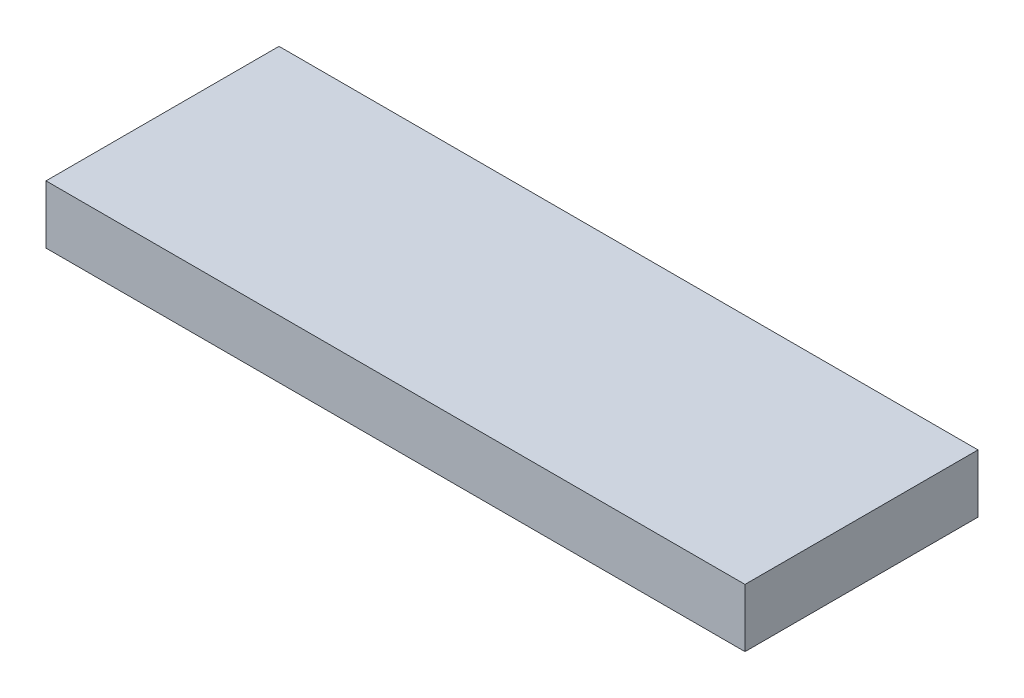
ISO-10303-21;
HEADER;
FILE_DESCRIPTION(('STEP AP214'),'2;1');
FILE_NAME('part.step','',(''),(''),'','','');
FILE_SCHEMA(('AUTOMOTIVE_DESIGN { 1 0 10303 214 1 1 1 1 }'));
ENDSEC;
DATA;
#1=APPLICATION_CONTEXT('core data for automotive mechanical design processes');
#2=APPLICATION_PROTOCOL_DEFINITION('international standard','automotive_design',2000,#1);
#3=PRODUCT_CONTEXT('',#1,'mechanical');
#4=PRODUCT('Part','Part','',(#3));
#5=PRODUCT_RELATED_PRODUCT_CATEGORY('part','',(#4));
#6=PRODUCT_DEFINITION_FORMATION('','',#4);
#7=PRODUCT_DEFINITION_CONTEXT('part definition',#1,'design');
#8=PRODUCT_DEFINITION('design','',#6,#7);
#9=PRODUCT_DEFINITION_SHAPE('','',#8);
#10=(LENGTH_UNIT() NAMED_UNIT(*) SI_UNIT(.MILLI.,.METRE.));
#11=(NAMED_UNIT(*) PLANE_ANGLE_UNIT() SI_UNIT($,.RADIAN.));
#12=(NAMED_UNIT(*) SI_UNIT($,.STERADIAN.) SOLID_ANGLE_UNIT());
#13=UNCERTAINTY_MEASURE_WITH_UNIT(LENGTH_MEASURE(1.E-05),#10,'distance_accuracy_value','');
#14=(GEOMETRIC_REPRESENTATION_CONTEXT(3) GLOBAL_UNCERTAINTY_ASSIGNED_CONTEXT((#13)) GLOBAL_UNIT_ASSIGNED_CONTEXT((#10,
#11,#12)) REPRESENTATION_CONTEXT('',''));
#15=CARTESIAN_POINT('',(0.,0.,0.));
#16=DIRECTION('',(0.,0.,1.));
#17=DIRECTION('',(1.,0.,0.));
#18=AXIS2_PLACEMENT_3D('',#15,#16,#17);
#19=CARTESIAN_POINT('',(60.,10.,-20.));
#20=DIRECTION('',(-1.,0.,0.));
#21=DIRECTION('',(0.,0.,1.));
#22=AXIS2_PLACEMENT_3D('',#19,#20,#21);
#23=PLANE('',#22);
#24=DIRECTION('',(0.,0.,-1.));
#25=VECTOR('',#24,1.);
#26=CARTESIAN_POINT('',(60.,0.,-20.));
#27=LINE('',#26,#25);
#28=CARTESIAN_POINT('',(60.,0.,20.));
#29=VERTEX_POINT('',#28);
#30=CARTESIAN_POINT('',(60.,0.,-20.));
#31=VERTEX_POINT('',#30);
#32=EDGE_CURVE('E96',#29,#31,#27,.T.);
#33=ORIENTED_EDGE('',*,*,#32,.T.);
#34=DIRECTION('',(0.,-1.,0.));
#35=VECTOR('',#34,1.);
#36=CARTESIAN_POINT('',(60.,10.,-20.));
#37=LINE('',#36,#35);
#38=CARTESIAN_POINT('',(60.,10.,-20.));
#39=VERTEX_POINT('',#38);
#40=EDGE_CURVE('E11',#39,#31,#37,.T.);
#41=ORIENTED_EDGE('',*,*,#40,.F.);
#42=DIRECTION('',(0.,0.,-1.));
#43=VECTOR('',#42,1.);
#44=CARTESIAN_POINT('',(60.,10.,-20.));
#45=LINE('',#44,#43);
#46=CARTESIAN_POINT('',(60.,10.,20.));
#47=VERTEX_POINT('',#46);
#48=EDGE_CURVE('E84',#47,#39,#45,.T.);
#49=ORIENTED_EDGE('',*,*,#48,.F.);
#50=DIRECTION('',(0.,-1.,0.));
#51=VECTOR('',#50,1.);
#52=CARTESIAN_POINT('',(60.,10.,20.));
#53=LINE('',#52,#51);
#54=EDGE_CURVE('E92',#47,#29,#53,.T.);
#55=ORIENTED_EDGE('',*,*,#54,.T.);
#56=EDGE_LOOP('',(#33,#41,#49,#55));
#57=FACE_BOUND('',#56,.T.);
#58=ADVANCED_FACE('F33',(#57),#23,.F.);
#59=CARTESIAN_POINT('',(-60.,10.,-20.));
#60=DIRECTION('',(0.,0.,1.));
#61=DIRECTION('',(1.,0.,0.));
#62=AXIS2_PLACEMENT_3D('',#59,#60,#61);
#63=PLANE('',#62);
#64=DIRECTION('',(-1.,0.,0.));
#65=VECTOR('',#64,1.);
#66=CARTESIAN_POINT('',(-60.,0.,-20.));
#67=LINE('',#66,#65);
#68=CARTESIAN_POINT('',(-60.,0.,-20.));
#69=VERTEX_POINT('',#68);
#70=EDGE_CURVE('E88',#31,#69,#67,.T.);
#71=ORIENTED_EDGE('',*,*,#70,.T.);
#72=DIRECTION('',(0.,-1.,0.));
#73=VECTOR('',#72,1.);
#74=CARTESIAN_POINT('',(-60.,10.,-20.));
#75=LINE('',#74,#73);
#76=CARTESIAN_POINT('',(-60.,10.,-20.));
#77=VERTEX_POINT('',#76);
#78=EDGE_CURVE('E41',#77,#69,#75,.T.);
#79=ORIENTED_EDGE('',*,*,#78,.F.);
#80=DIRECTION('',(-1.,0.,0.));
#81=VECTOR('',#80,1.);
#82=CARTESIAN_POINT('',(-60.,10.,-20.));
#83=LINE('',#82,#81);
#84=EDGE_CURVE('E79',#39,#77,#83,.T.);
#85=ORIENTED_EDGE('',*,*,#84,.F.);
#86=ORIENTED_EDGE('',*,*,#40,.T.);
#87=EDGE_LOOP('',(#71,#79,#85,#86));
#88=FACE_BOUND('',#87,.T.);
#89=ADVANCED_FACE('F87',(#88),#63,.F.);
#90=CARTESIAN_POINT('',(-60.,10.,-20.));
#91=DIRECTION('',(1.,0.,0.));
#92=DIRECTION('',(0.,0.,-1.));
#93=AXIS2_PLACEMENT_3D('',#90,#91,#92);
#94=PLANE('',#93);
#95=DIRECTION('',(0.,0.,1.));
#96=VECTOR('',#95,1.);
#97=CARTESIAN_POINT('',(-60.,0.,-20.));
#98=LINE('',#97,#96);
#99=CARTESIAN_POINT('',(-60.,0.,20.));
#100=VERTEX_POINT('',#99);
#101=EDGE_CURVE('E66',#69,#100,#98,.T.);
#102=ORIENTED_EDGE('',*,*,#101,.T.);
#103=DIRECTION('',(0.,-1.,0.));
#104=VECTOR('',#103,1.);
#105=CARTESIAN_POINT('',(-60.,10.,20.));
#106=LINE('',#105,#104);
#107=CARTESIAN_POINT('',(-60.,10.,20.));
#108=VERTEX_POINT('',#107);
#109=EDGE_CURVE('E89',#108,#100,#106,.T.);
#110=ORIENTED_EDGE('',*,*,#109,.F.);
#111=DIRECTION('',(0.,0.,1.));
#112=VECTOR('',#111,1.);
#113=CARTESIAN_POINT('',(-60.,10.,-20.));
#114=LINE('',#113,#112);
#115=EDGE_CURVE('E82',#77,#108,#114,.T.);
#116=ORIENTED_EDGE('',*,*,#115,.F.);
#117=ORIENTED_EDGE('',*,*,#78,.T.);
#118=EDGE_LOOP('',(#102,#110,#116,#117));
#119=FACE_BOUND('',#118,.T.);
#120=ADVANCED_FACE('F90',(#119),#94,.F.);
#121=CARTESIAN_POINT('',(-60.,10.,20.));
#122=DIRECTION('',(0.,0.,-1.));
#123=DIRECTION('',(-1.,0.,0.));
#124=AXIS2_PLACEMENT_3D('',#121,#122,#123);
#125=PLANE('',#124);
#126=DIRECTION('',(1.,0.,0.));
#127=VECTOR('',#126,1.);
#128=CARTESIAN_POINT('',(-60.,0.,20.));
#129=LINE('',#128,#127);
#130=EDGE_CURVE('E72',#100,#29,#129,.T.);
#131=ORIENTED_EDGE('',*,*,#130,.T.);
#132=ORIENTED_EDGE('',*,*,#54,.F.);
#133=DIRECTION('',(1.,0.,0.));
#134=VECTOR('',#133,1.);
#135=CARTESIAN_POINT('',(-60.,10.,20.));
#136=LINE('',#135,#134);
#137=EDGE_CURVE('E49',#108,#47,#136,.T.);
#138=ORIENTED_EDGE('',*,*,#137,.F.);
#139=ORIENTED_EDGE('',*,*,#109,.T.);
#140=EDGE_LOOP('',(#131,#132,#138,#139));
#141=FACE_BOUND('',#140,.T.);
#142=ADVANCED_FACE('F103',(#141),#125,.F.);
#143=CARTESIAN_POINT('',(0.,10.,0.));
#144=DIRECTION('',(0.,1.,0.));
#145=DIRECTION('',(0.,0.,1.));
#146=AXIS2_PLACEMENT_3D('',#143,#144,#145);
#147=PLANE('',#146);
#148=ORIENTED_EDGE('',*,*,#48,.T.);
#149=ORIENTED_EDGE('',*,*,#84,.T.);
#150=ORIENTED_EDGE('',*,*,#115,.T.);
#151=ORIENTED_EDGE('',*,*,#137,.T.);
#152=EDGE_LOOP('',(#148,#149,#150,#151));
#153=FACE_BOUND('',#152,.T.);
#154=ADVANCED_FACE('F80',(#153),#147,.T.);
#155=CARTESIAN_POINT('',(0.,0.,0.));
#156=DIRECTION('',(0.,1.,0.));
#157=DIRECTION('',(0.,0.,1.));
#158=AXIS2_PLACEMENT_3D('',#155,#156,#157);
#159=PLANE('',#158);
#160=ORIENTED_EDGE('',*,*,#32,.F.);
#161=ORIENTED_EDGE('',*,*,#130,.F.);
#162=ORIENTED_EDGE('',*,*,#101,.F.);
#163=ORIENTED_EDGE('',*,*,#70,.F.);
#164=EDGE_LOOP('',(#160,#161,#162,#163));
#165=FACE_BOUND('',#164,.T.);
#166=ADVANCED_FACE('F106',(#165),#159,.F.);
#167=CLOSED_SHELL('',(#58,#89,#120,#142,#154,#166));
#168=MANIFOLD_SOLID_BREP('B2',#167);
#169=ADVANCED_BREP_SHAPE_REPRESENTATION('',(#18,#168),#14);
#170=SHAPE_DEFINITION_REPRESENTATION(#9,#169);
ENDSEC;
END-ISO-10303-21;
